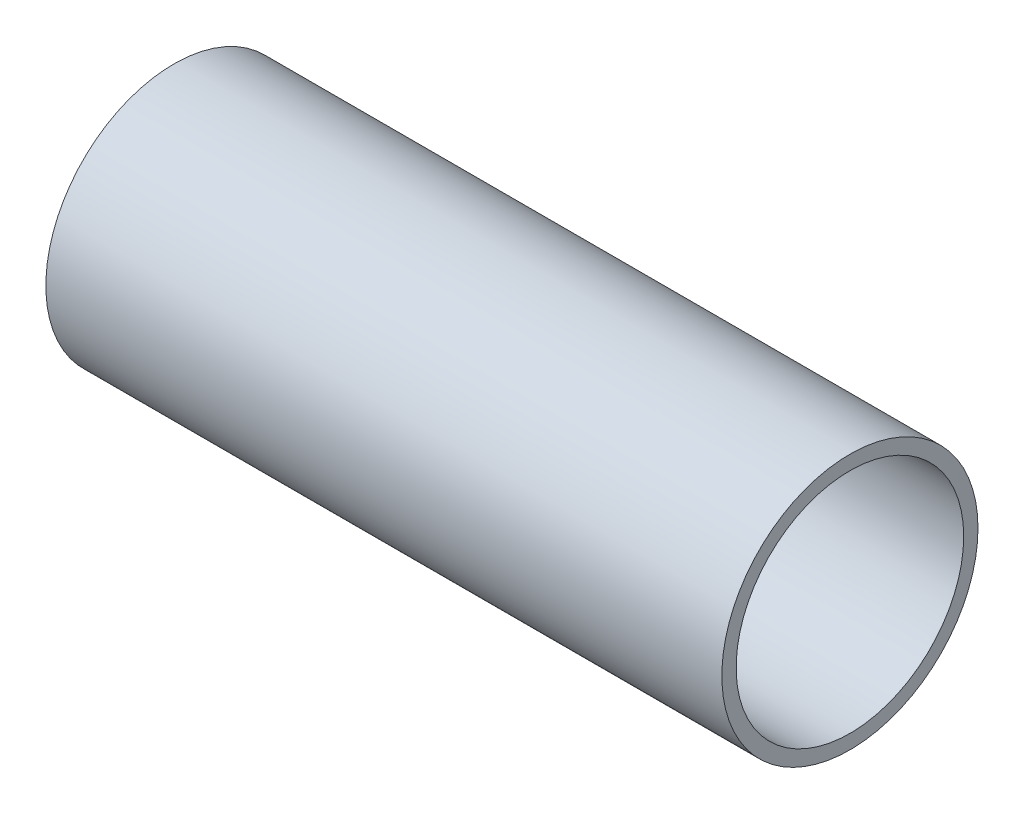
ISO-10303-21;
HEADER;
FILE_DESCRIPTION(('STEP AP214'),'2;1');
FILE_NAME('part.step','',(''),(''),'','','');
FILE_SCHEMA(('AUTOMOTIVE_DESIGN { 1 0 10303 214 1 1 1 1 }'));
ENDSEC;
DATA;
#1=APPLICATION_CONTEXT('core data for automotive mechanical design processes');
#2=APPLICATION_PROTOCOL_DEFINITION('international standard','automotive_design',2000,#1);
#3=PRODUCT_CONTEXT('',#1,'mechanical');
#4=PRODUCT('Part','Part','',(#3));
#5=PRODUCT_RELATED_PRODUCT_CATEGORY('part','',(#4));
#6=PRODUCT_DEFINITION_FORMATION('','',#4);
#7=PRODUCT_DEFINITION_CONTEXT('part definition',#1,'design');
#8=PRODUCT_DEFINITION('design','',#6,#7);
#9=PRODUCT_DEFINITION_SHAPE('','',#8);
#10=(LENGTH_UNIT() NAMED_UNIT(*) SI_UNIT(.MILLI.,.METRE.));
#11=(NAMED_UNIT(*) PLANE_ANGLE_UNIT() SI_UNIT($,.RADIAN.));
#12=(NAMED_UNIT(*) SI_UNIT($,.STERADIAN.) SOLID_ANGLE_UNIT());
#13=UNCERTAINTY_MEASURE_WITH_UNIT(LENGTH_MEASURE(1.E-05),#10,'distance_accuracy_value','');
#14=(GEOMETRIC_REPRESENTATION_CONTEXT(3) GLOBAL_UNCERTAINTY_ASSIGNED_CONTEXT((#13)) GLOBAL_UNIT_ASSIGNED_CONTEXT((#10,
#11,#12)) REPRESENTATION_CONTEXT('',''));
#15=CARTESIAN_POINT('',(0.,0.,0.));
#16=DIRECTION('',(0.,0.,1.));
#17=DIRECTION('',(1.,0.,0.));
#18=AXIS2_PLACEMENT_3D('',#15,#16,#17);
#19=CARTESIAN_POINT('',(301.625,0.,0.));
#20=DIRECTION('',(1.,0.,0.));
#21=DIRECTION('',(0.,0.,-1.));
#22=AXIS2_PLACEMENT_3D('',#19,#20,#21);
#23=PLANE('',#22);
#24=CARTESIAN_POINT('',(301.625,0.,0.));
#25=DIRECTION('',(1.,0.,0.));
#26=DIRECTION('',(0.,0.,-1.));
#27=AXIS2_PLACEMENT_3D('',#24,#25,#26);
#28=CIRCLE('',#27,57.15);
#29=CARTESIAN_POINT('',(301.625,0.,-57.15));
#30=VERTEX_POINT('',#29);
#31=EDGE_CURVE('E10',#30,#30,#28,.T.);
#32=ORIENTED_EDGE('',*,*,#31,.T.);
#33=EDGE_LOOP('',(#32));
#34=FACE_BOUND('',#33,.T.);
#35=CARTESIAN_POINT('',(301.625,0.,0.));
#36=DIRECTION('',(1.,0.,0.));
#37=DIRECTION('',(0.,0.,-1.));
#38=AXIS2_PLACEMENT_3D('',#35,#36,#37);
#39=CIRCLE('',#38,50.7746);
#40=CARTESIAN_POINT('',(301.625,0.,-50.7746));
#41=VERTEX_POINT('',#40);
#42=EDGE_CURVE('E57',#41,#41,#39,.T.);
#43=ORIENTED_EDGE('',*,*,#42,.F.);
#44=EDGE_LOOP('',(#43));
#45=FACE_BOUND('',#44,.T.);
#46=ADVANCED_FACE('F43',(#34,#45),#23,.T.);
#47=CARTESIAN_POINT('',(0.,0.,0.));
#48=DIRECTION('',(1.,0.,0.));
#49=DIRECTION('',(0.,0.,-1.));
#50=AXIS2_PLACEMENT_3D('',#47,#48,#49);
#51=PLANE('',#50);
#52=CARTESIAN_POINT('',(0.,0.,0.));
#53=DIRECTION('',(1.,0.,0.));
#54=DIRECTION('',(0.,0.,-1.));
#55=AXIS2_PLACEMENT_3D('',#52,#53,#54);
#56=CIRCLE('',#55,57.15);
#57=CARTESIAN_POINT('',(0.,0.,-57.15));
#58=VERTEX_POINT('',#57);
#59=EDGE_CURVE('E47',#58,#58,#56,.T.);
#60=ORIENTED_EDGE('',*,*,#59,.F.);
#61=EDGE_LOOP('',(#60));
#62=FACE_BOUND('',#61,.T.);
#63=CARTESIAN_POINT('',(0.,0.,0.));
#64=DIRECTION('',(1.,0.,0.));
#65=DIRECTION('',(0.,0.,-1.));
#66=AXIS2_PLACEMENT_3D('',#63,#64,#65);
#67=CIRCLE('',#66,50.7746);
#68=CARTESIAN_POINT('',(0.,0.,-50.7746));
#69=VERTEX_POINT('',#68);
#70=EDGE_CURVE('E59',#69,#69,#67,.T.);
#71=ORIENTED_EDGE('',*,*,#70,.T.);
#72=EDGE_LOOP('',(#71));
#73=FACE_BOUND('',#72,.T.);
#74=ADVANCED_FACE('F72',(#62,#73),#51,.F.);
#75=CARTESIAN_POINT('',(301.625,0.,0.));
#76=DIRECTION('',(-1.,0.,0.));
#77=DIRECTION('',(0.,0.,1.));
#78=AXIS2_PLACEMENT_3D('',#75,#76,#77);
#79=CYLINDRICAL_SURFACE('',#78,57.15);
#80=ORIENTED_EDGE('',*,*,#31,.F.);
#81=EDGE_LOOP('',(#80));
#82=FACE_BOUND('',#81,.T.);
#83=ORIENTED_EDGE('',*,*,#59,.T.);
#84=EDGE_LOOP('',(#83));
#85=FACE_BOUND('',#84,.T.);
#86=ADVANCED_FACE('F45',(#82,#85),#79,.T.);
#87=CARTESIAN_POINT('',(301.625,0.,0.));
#88=DIRECTION('',(-1.,0.,0.));
#89=DIRECTION('',(0.,0.,1.));
#90=AXIS2_PLACEMENT_3D('',#87,#88,#89);
#91=CYLINDRICAL_SURFACE('',#90,50.7746);
#92=ORIENTED_EDGE('',*,*,#42,.T.);
#93=EDGE_LOOP('',(#92));
#94=FACE_BOUND('',#93,.T.);
#95=ORIENTED_EDGE('',*,*,#70,.F.);
#96=EDGE_LOOP('',(#95));
#97=FACE_BOUND('',#96,.T.);
#98=ADVANCED_FACE('F68',(#94,#97),#91,.F.);
#99=CLOSED_SHELL('',(#46,#74,#86,#98));
#100=MANIFOLD_SOLID_BREP('B2',#99);
#101=ADVANCED_BREP_SHAPE_REPRESENTATION('',(#18,#100),#14);
#102=SHAPE_DEFINITION_REPRESENTATION(#9,#101);
ENDSEC;
END-ISO-10303-21;
